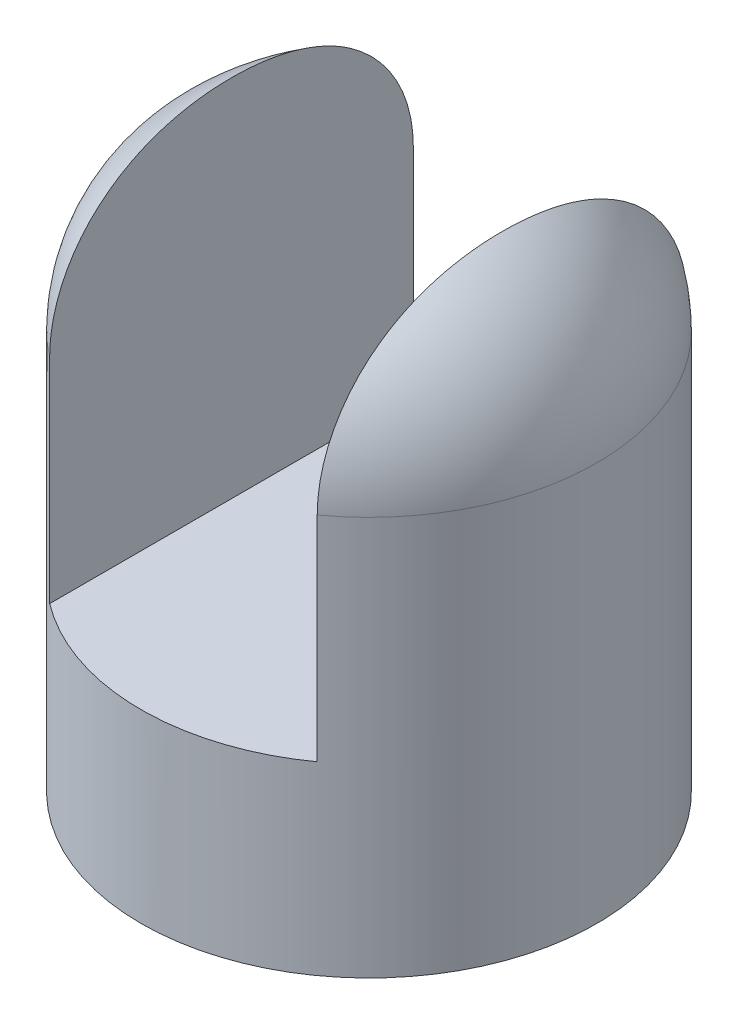
ISO-10303-21;
HEADER;
FILE_DESCRIPTION(('STEP AP214'),'2;1');
FILE_NAME('part.step','',(''),(''),'','','');
FILE_SCHEMA(('AUTOMOTIVE_DESIGN { 1 0 10303 214 1 1 1 1 }'));
ENDSEC;
DATA;
#1=APPLICATION_CONTEXT('core data for automotive mechanical design processes');
#2=APPLICATION_PROTOCOL_DEFINITION('international standard','automotive_design',2000,#1);
#3=PRODUCT_CONTEXT('',#1,'mechanical');
#4=PRODUCT('Part','Part','',(#3));
#5=PRODUCT_RELATED_PRODUCT_CATEGORY('part','',(#4));
#6=PRODUCT_DEFINITION_FORMATION('','',#4);
#7=PRODUCT_DEFINITION_CONTEXT('part definition',#1,'design');
#8=PRODUCT_DEFINITION('design','',#6,#7);
#9=PRODUCT_DEFINITION_SHAPE('','',#8);
#10=(LENGTH_UNIT() NAMED_UNIT(*) SI_UNIT(.MILLI.,.METRE.));
#11=(NAMED_UNIT(*) PLANE_ANGLE_UNIT() SI_UNIT($,.RADIAN.));
#12=(NAMED_UNIT(*) SI_UNIT($,.STERADIAN.) SOLID_ANGLE_UNIT());
#13=UNCERTAINTY_MEASURE_WITH_UNIT(LENGTH_MEASURE(1.E-05),#10,'distance_accuracy_value','');
#14=(GEOMETRIC_REPRESENTATION_CONTEXT(3) GLOBAL_UNCERTAINTY_ASSIGNED_CONTEXT((#13)) GLOBAL_UNIT_ASSIGNED_CONTEXT((#10,
#11,#12)) REPRESENTATION_CONTEXT('',''));
#15=CARTESIAN_POINT('',(0.,0.,0.));
#16=DIRECTION('',(0.,0.,1.));
#17=DIRECTION('',(1.,0.,0.));
#18=AXIS2_PLACEMENT_3D('',#15,#16,#17);
#19=CARTESIAN_POINT('',(0.,140.,0.));
#20=DIRECTION('',(0.,1.,0.));
#21=DIRECTION('',(0.,0.,1.));
#22=AXIS2_PLACEMENT_3D('',#19,#20,#21);
#23=DEGENERATE_TOROIDAL_SURFACE('',#22,20.,60.,.T.);
#24=CARTESIAN_POINT('',(46.75,193.70695951178,0.));
#25=CARTESIAN_POINT('',(46.75,193.706959355465,-1.04296900027614));
#26=CARTESIAN_POINT('',(46.75,193.689592250468,-2.0859364663582));
#27=CARTESIAN_POINT('',(46.75,193.619924922244,-4.1707079732286));
#28=CARTESIAN_POINT('',(46.75,193.567624743968,-5.21251201551227));
#29=CARTESIAN_POINT('',(46.75,193.42750611643,-7.29379594061906));
#30=CARTESIAN_POINT('',(46.75,193.339685760588,-8.33327569567168));
#31=CARTESIAN_POINT('',(46.75,193.127608802382,-10.4085165200169));
#32=CARTESIAN_POINT('',(46.75,193.003352322436,-11.4442776017916));
#33=CARTESIAN_POINT('',(46.75,192.717489338953,-13.5085659530315));
#34=CARTESIAN_POINT('',(46.75,192.555957886585,-14.5371035351462));
#35=CARTESIAN_POINT('',(46.75,192.194048713823,-16.5873376307818));
#36=CARTESIAN_POINT('',(46.75,191.993668130483,-17.6090336343752));
#37=CARTESIAN_POINT('',(46.75,191.332109944078,-20.6605865099879));
#38=CARTESIAN_POINT('',(46.75,190.810391226477,-22.6778307828778));
#39=CARTESIAN_POINT('',(46.75,189.702716323285,-26.3039893667464));
#40=CARTESIAN_POINT('',(46.75,189.144870256703,-27.921490982772));
#41=CARTESIAN_POINT('',(46.75,188.216822968061,-30.3121250565437));
#42=CARTESIAN_POINT('',(46.75,187.892231571076,-31.1031278129538));
#43=CARTESIAN_POINT('',(46.75,187.212126523189,-32.671697589858));
#44=CARTESIAN_POINT('',(46.75,186.856615431585,-33.4492657159952));
#45=CARTESIAN_POINT('',(46.75,186.114288613802,-34.9893362948177));
#46=CARTESIAN_POINT('',(46.75,185.727472312559,-35.7518384704277));
#47=CARTESIAN_POINT('',(46.75,184.922362979877,-37.2599550036553));
#48=CARTESIAN_POINT('',(46.75,184.504073247336,-38.0055711205623));
#49=CARTESIAN_POINT('',(46.75,183.635859430898,-39.4783077937409));
#50=CARTESIAN_POINT('',(46.75,183.185930920142,-40.2054257423118));
#51=CARTESIAN_POINT('',(46.75,182.254643781824,-41.6391491043174));
#52=CARTESIAN_POINT('',(46.75,181.77328858633,-42.345756745522));
#53=CARTESIAN_POINT('',(46.75,180.775417611267,-43.7422226436057));
#54=CARTESIAN_POINT('',(46.75,180.258652569201,-44.4319029220102));
#55=CARTESIAN_POINT('',(46.75,179.193931737608,-45.7866336319624));
#56=CARTESIAN_POINT('',(46.75,178.645979661751,-46.4516869805171));
#57=CARTESIAN_POINT('',(46.75,177.519356154677,-47.7554611258036));
#58=CARTESIAN_POINT('',(46.75,176.940679398783,-48.3941773239298));
#59=CARTESIAN_POINT('',(46.75,175.753569969113,-49.64319125844));
#60=CARTESIAN_POINT('',(46.75,175.145141082172,-50.2534925922481));
#61=CARTESIAN_POINT('',(46.75,173.899472000412,-51.4438750298461));
#62=CARTESIAN_POINT('',(46.75,173.262233804862,-52.0239582246785));
#63=CARTESIAN_POINT('',(46.75,171.960132152541,-53.1520772032915));
#64=CARTESIAN_POINT('',(46.75,171.295272233073,-53.7001170691092));
#65=CARTESIAN_POINT('',(46.75,169.939158106685,-54.7624804514655));
#66=CARTESIAN_POINT('',(46.75,169.247905140668,-55.2768055500647));
#67=CARTESIAN_POINT('',(46.75,167.84052464221,-56.2700562293278));
#68=CARTESIAN_POINT('',(46.75,167.124397965263,-56.7489830256926));
#69=CARTESIAN_POINT('',(46.75,165.11995612022,-58.0170944617484));
#70=CARTESIAN_POINT('',(46.75,163.807160806099,-58.7680816227451));
#71=CARTESIAN_POINT('',(46.75,161.119452158116,-60.1485290778007));
#72=CARTESIAN_POINT('',(46.75,159.744544141508,-60.7779997502303));
#73=CARTESIAN_POINT('',(46.75,156.943628601205,-61.9087904702172));
#74=CARTESIAN_POINT('',(46.75,155.51764412838,-62.4101675160393));
#75=CARTESIAN_POINT('',(46.75,152.625642641165,-63.2797554126105));
#76=CARTESIAN_POINT('',(46.75,151.159627289038,-63.647971783776));
#77=CARTESIAN_POINT('',(46.75,148.307315766803,-64.2255642639269));
#78=CARTESIAN_POINT('',(46.75,146.922952754579,-64.4445264503466));
#79=CARTESIAN_POINT('',(46.75,144.140563727809,-64.7625208226389));
#80=CARTESIAN_POINT('',(46.75,142.742538521351,-64.8615600589238));
#81=CARTESIAN_POINT('',(46.75,139.943382380733,-64.9387897248246));
#82=CARTESIAN_POINT('',(46.75,138.542251969958,-64.9169991704336));
#83=CARTESIAN_POINT('',(46.75,135.747068985271,-64.7528175365386));
#84=CARTESIAN_POINT('',(46.75,134.35301641142,-64.6104264559966));
#85=CARTESIAN_POINT('',(46.75,131.611697684981,-64.2106615651844));
#86=CARTESIAN_POINT('',(46.75,130.264066040833,-63.9557877873997));
#87=CARTESIAN_POINT('',(46.75,127.594928265786,-63.3340503569763));
#88=CARTESIAN_POINT('',(46.75,126.273421569365,-62.9671891313379));
#89=CARTESIAN_POINT('',(46.75,123.66565455782,-62.1247414058643));
#90=CARTESIAN_POINT('',(46.75,122.379391871626,-61.6491622403308));
#91=CARTESIAN_POINT('',(46.75,119.850545252717,-60.5934118670751));
#92=CARTESIAN_POINT('',(46.75,118.607961938597,-60.0132391787917));
#93=CARTESIAN_POINT('',(46.75,116.160215530037,-58.7459545804263));
#94=CARTESIAN_POINT('',(46.75,114.955656901199,-58.0576757489175));
#95=CARTESIAN_POINT('',(46.75,112.60675832066,-56.5851348742164));
#96=CARTESIAN_POINT('',(46.75,111.462418357641,-55.8008728490632));
#97=CARTESIAN_POINT('',(46.75,109.240313733237,-54.142900266252));
#98=CARTESIAN_POINT('',(46.75,108.162559735756,-53.2691754401431));
#99=CARTESIAN_POINT('',(46.75,106.079186159357,-51.4393987348995));
#100=CARTESIAN_POINT('',(46.75,105.073568833472,-50.4833442864281));
#101=CARTESIAN_POINT('',(46.75,103.59982519235,-48.9698926162134));
#102=CARTESIAN_POINT('',(46.75,103.103744353783,-48.4394052566122));
#103=CARTESIAN_POINT('',(46.75,102.133101510036,-47.3590781820884));
#104=CARTESIAN_POINT('',(46.75,101.658538843693,-46.8092390626869));
#105=CARTESIAN_POINT('',(46.75,100.731410342164,-45.6913899844499));
#106=CARTESIAN_POINT('',(46.75,100.278843048312,-45.1233812347214));
#107=CARTESIAN_POINT('',(46.75,99.3959533090566,-43.9702442278246));
#108=CARTESIAN_POINT('',(46.75,98.9656341766164,-43.3851134412202));
#109=CARTESIAN_POINT('',(46.75,97.7089142781767,-41.6063711027726));
#110=CARTESIAN_POINT('',(46.75,96.916193180499,-40.3887350904115));
#111=CARTESIAN_POINT('',(46.75,95.4218425355682,-37.8987083505486));
#112=CARTESIAN_POINT('',(46.75,94.7202298586646,-36.6263075402788));
#113=CARTESIAN_POINT('',(46.75,93.6191412541539,-34.4529673178528));
#114=CARTESIAN_POINT('',(46.75,93.195125212839,-33.564350658742));
#115=CARTESIAN_POINT('',(46.75,92.3883676104953,-31.7687848654886));
#116=CARTESIAN_POINT('',(46.75,92.0056175514726,-30.8618395516621));
#117=CARTESIAN_POINT('',(46.75,91.2804884095964,-29.0316235417884));
#118=CARTESIAN_POINT('',(46.75,90.9381226017503,-28.1083475916287));
#119=CARTESIAN_POINT('',(46.75,90.2929890708497,-26.2481010022608));
#120=CARTESIAN_POINT('',(46.75,89.9902236156741,-25.311129582138));
#121=CARTESIAN_POINT('',(46.75,89.1379675597991,-22.4769512974009));
#122=CARTESIAN_POINT('',(46.75,88.6466329909228,-20.5618738591813));
#123=CARTESIAN_POINT('',(46.75,88.0187115735033,-17.6664664762047));
#124=CARTESIAN_POINT('',(46.75,87.8275678903318,-16.6974128568714));
#125=CARTESIAN_POINT('',(46.75,87.4803139626789,-14.7530503796455));
#126=CARTESIAN_POINT('',(46.75,87.3242014838578,-13.7777419247788));
#127=CARTESIAN_POINT('',(46.75,87.0044325794007,-11.5315067771186));
#128=CARTESIAN_POINT('',(46.75,86.8523415591451,-10.2589305359459));
#129=CARTESIAN_POINT('',(46.75,86.6029249537858,-7.70838942249325));
#130=CARTESIAN_POINT('',(46.75,86.5056027666404,-6.4304242208269));
#131=CARTESIAN_POINT('',(46.75,86.3641403009632,-3.87103524887993));
#132=CARTESIAN_POINT('',(46.75,86.3200221207468,-2.58961026289296));
#133=CARTESIAN_POINT('',(46.75,86.2842859947163,-0.0260616712545729));
#134=CARTESIAN_POINT('',(46.75,86.2926669325234,1.25606191896151));
#135=CARTESIAN_POINT('',(46.75,86.3620414585753,3.81774962660607));
#136=CARTESIAN_POINT('',(46.75,86.42298808042,5.09731500709556));
#137=CARTESIAN_POINT('',(46.75,86.5984594916663,7.65281747074327));
#138=CARTESIAN_POINT('',(46.75,86.7129856077716,8.92875446327039));
#139=CARTESIAN_POINT('',(46.75,86.9973418591094,11.4738594311755));
#140=CARTESIAN_POINT('',(46.75,87.1671445863849,12.7430304450184));
#141=CARTESIAN_POINT('',(46.75,87.5644018427874,15.2721997726354));
#142=CARTESIAN_POINT('',(46.75,87.7918512986225,16.5321988835644));
#143=CARTESIAN_POINT('',(46.75,88.4179029806281,19.5790886990057));
#144=CARTESIAN_POINT('',(46.75,88.8480479592862,21.3596251248479));
#145=CARTESIAN_POINT('',(46.75,89.8398841261424,24.8839703714337));
#146=CARTESIAN_POINT('',(46.75,90.4015647288397,26.6277821353404));
#147=CARTESIAN_POINT('',(46.75,91.3470732963276,29.2033792222277));
#148=CARTESIAN_POINT('',(46.75,91.6790470507545,30.0544433929371));
#149=CARTESIAN_POINT('',(46.75,92.3780726532325,31.742008441715));
#150=CARTESIAN_POINT('',(46.75,92.7451210425534,32.5785107461404));
#151=CARTESIAN_POINT('',(46.75,93.5148116166365,34.234956881433));
#152=CARTESIAN_POINT('',(46.75,93.9174523108858,35.0549014039321));
#153=CARTESIAN_POINT('',(46.75,94.758608744591,36.6760999411685));
#154=CARTESIAN_POINT('',(46.75,95.1971232044855,37.4773546212345));
#155=CARTESIAN_POINT('',(46.75,96.4291586903317,39.6115489365045));
#156=CARTESIAN_POINT('',(46.75,97.2567556345636,40.9250643695513));
#157=CARTESIAN_POINT('',(46.75,99.0151200746949,43.4809447405424));
#158=CARTESIAN_POINT('',(46.75,99.9458784965012,44.7233159217851));
#159=CARTESIAN_POINT('',(46.75,101.908564120026,47.1266382928908));
#160=CARTESIAN_POINT('',(46.75,102.940541478069,48.287548623277));
#161=CARTESIAN_POINT('',(46.75,105.100797232742,50.5161976417054));
#162=CARTESIAN_POINT('',(46.75,106.229077487043,51.5839345316398));
#163=CARTESIAN_POINT('',(46.75,108.580591612138,53.61984454103));
#164=CARTESIAN_POINT('',(46.75,109.804204195847,54.5875808982611));
#165=CARTESIAN_POINT('',(46.75,112.334176687673,56.408252476526));
#166=CARTESIAN_POINT('',(46.75,113.640537944739,57.2611858253587));
#167=CARTESIAN_POINT('',(46.75,116.325962574945,58.8428182690556));
#168=CARTESIAN_POINT('',(46.75,117.705004414626,59.5715538927372));
#169=CARTESIAN_POINT('',(46.75,120.525101007595,60.897029382309));
#170=CARTESIAN_POINT('',(46.75,121.966150874337,61.4937796266378));
#171=CARTESIAN_POINT('',(46.75,124.778109502474,62.5054761452741));
#172=CARTESIAN_POINT('',(46.75,126.145115110782,62.9313001134091));
#173=CARTESIAN_POINT('',(46.75,128.911051086245,63.6620125499558));
#174=CARTESIAN_POINT('',(46.75,130.309979609313,63.9669079854211));
#175=CARTESIAN_POINT('',(46.75,133.128874370563,64.4527753386829));
#176=CARTESIAN_POINT('',(46.75,134.548835867649,64.6337747626386));
#177=CARTESIAN_POINT('',(46.75,137.399180130897,64.8702008165685));
#178=CARTESIAN_POINT('',(46.75,138.829562751189,64.9256292008501));
#179=CARTESIAN_POINT('',(46.75,141.635803520639,64.9106719005193));
#180=CARTESIAN_POINT('',(46.75,143.011688740877,64.8449403682032));
#181=CARTESIAN_POINT('',(46.75,145.75292634814,64.5972904608244));
#182=CARTESIAN_POINT('',(46.75,147.118279074878,64.4153758490884));
#183=CARTESIAN_POINT('',(46.75,149.828618344037,63.9370221632662));
#184=CARTESIAN_POINT('',(46.75,151.173606862302,63.6405942748293));
#185=CARTESIAN_POINT('',(46.75,153.833941588073,62.9358630375574));
#186=CARTESIAN_POINT('',(46.75,155.149287546886,62.5275587504951));
#187=CARTESIAN_POINT('',(46.75,157.739878376959,61.603214489203));
#188=CARTESIAN_POINT('',(46.75,159.015166388027,61.0872953302003));
#189=CARTESIAN_POINT('',(46.75,161.518763101622,59.951962650212));
#190=CARTESIAN_POINT('',(46.75,162.747072159306,59.3325499118212));
#191=CARTESIAN_POINT('',(46.75,165.149063633095,57.9955253562769));
#192=CARTESIAN_POINT('',(46.75,166.322743427309,57.2779088324064));
#193=CARTESIAN_POINT('',(46.75,168.608512677396,55.7505499503786));
#194=CARTESIAN_POINT('',(46.75,169.72060081223,54.9408056173689));
#195=CARTESIAN_POINT('',(46.75,171.91101889656,53.2090887511299));
#196=CARTESIAN_POINT('',(46.75,172.987194320122,52.2843917869976));
#197=CARTESIAN_POINT('',(46.75,175.062116952993,50.351952819365));
#198=CARTESIAN_POINT('',(46.75,176.060863139526,49.3442097192572));
#199=CARTESIAN_POINT('',(46.75,177.976633475867,47.2539390805297));
#200=CARTESIAN_POINT('',(46.75,178.893658563713,46.171412400568));
#201=CARTESIAN_POINT('',(46.75,180.642996624587,43.9400199458809));
#202=CARTESIAN_POINT('',(46.75,181.475306600549,42.7911518263678));
#203=CARTESIAN_POINT('',(46.75,183.1145334946,40.3444145110728));
#204=CARTESIAN_POINT('',(46.75,183.914505718226,39.0418939372309));
#205=CARTESIAN_POINT('',(46.75,185.413558793557,36.3801661219372));
#206=CARTESIAN_POINT('',(46.75,186.112636092806,35.0209568866784));
#207=CARTESIAN_POINT('',(46.75,187.411270205964,32.2552807430195));
#208=CARTESIAN_POINT('',(46.75,188.010789241212,30.8487961376899));
#209=CARTESIAN_POINT('',(46.75,189.112569327126,27.9983716210833));
#210=CARTESIAN_POINT('',(46.75,189.614822088047,26.5544285292014));
#211=CARTESIAN_POINT('',(46.75,190.701783290348,23.0737321640487));
#212=CARTESIAN_POINT('',(46.75,191.243432882121,21.0233866860826));
#213=CARTESIAN_POINT('',(46.75,191.930019166044,17.9206676525278));
#214=CARTESIAN_POINT('',(46.75,192.137939607997,16.8816061202439));
#215=CARTESIAN_POINT('',(46.75,192.51341875749,14.7961544785234));
#216=CARTESIAN_POINT('',(46.75,192.680978125457,13.7497644892905));
#217=CARTESIAN_POINT('',(46.75,192.97748887142,11.6492347367863));
#218=CARTESIAN_POINT('',(46.75,193.106354768251,10.5950830099672));
#219=CARTESIAN_POINT('',(46.75,193.326266552774,8.48284337026949));
#220=CARTESIAN_POINT('',(46.75,193.417312196765,7.42475543207131));
#221=CARTESIAN_POINT('',(46.75,193.562558195086,5.30616779914778));
#222=CARTESIAN_POINT('',(46.75,193.616762067512,4.24566834440959));
#223=CARTESIAN_POINT('',(46.75,193.688962740668,2.12344539356614));
#224=CARTESIAN_POINT('',(46.75,193.706959670906,1.06172190185276));
#225=CARTESIAN_POINT('',(46.75,193.70695951178,0.));
#226=B_SPLINE_CURVE_WITH_KNOTS('',3,(#24,#25,#26,#27,#28,#29,#30,#31,#32,#33,#34,#35,#36,#37,
#38,#39,#40,#41,#42,#43,#44,#45,#46,#47,#48,#49,#50,#51,#52,#53,#54,#55,#56,#57,#58,#59,#60,#61,
#62,#63,#64,#65,#66,#67,#68,#69,#70,#71,#72,#73,#74,#75,#76,#77,#78,#79,#80,#81,#82,#83,#84,#85,
#86,#87,#88,#89,#90,#91,#92,#93,#94,#95,#96,#97,#98,#99,#100,#101,#102,#103,#104,#105,#106,#107,
#108,#109,#110,#111,#112,#113,#114,#115,#116,#117,#118,#119,#120,#121,#122,#123,#124,#125,#126,
#127,#128,#129,#130,#131,#132,#133,#134,#135,#136,#137,#138,#139,#140,#141,#142,#143,#144,#145,
#146,#147,#148,#149,#150,#151,#152,#153,#154,#155,#156,#157,#158,#159,#160,#161,#162,#163,#164,
#165,#166,#167,#168,#169,#170,#171,#172,#173,#174,#175,#176,#177,#178,#179,#180,#181,#182,#183,
#184,#185,#186,#187,#188,#189,#190,#191,#192,#193,#194,#195,#196,#197,#198,#199,#200,#201,#202,
#203,#204,#205,#206,#207,#208,#209,#210,#211,#212,#213,#214,#215,#216,#217,#218,#219,#220,#221,
#222,#223,#224,#225),.UNSPECIFIED.,.T.,.F.,(4,2,2,2,2,2,2,2,2,2,2,2,2,2,2,2,2,2,2,2,2,2,2,2,2,2,
2,2,2,2,2,2,2,2,2,2,2,2,2,2,2,2,2,2,2,2,2,2,2,2,2,2,2,2,2,2,2,2,2,2,2,2,2,2,2,2,2,2,2,2,2,2,2,2,
2,2,2,2,2,2,2,2,2,2,2,2,2,2,2,2,2,2,2,2,2,2,2,2,2,2,4),(0.,3.12875838725811,6.25751274854812,
9.38643507117931,12.515346881514,15.6380129307092,18.7609091891814,25.0039163159907,
30.1320333740228,32.6964973969225,35.2607493545228,37.825048427029,40.3890790950564,
42.9534692357021,45.5175797895031,48.1020898176859,50.6862927305482,53.2709449645918,
55.8552690775879,58.4394141216753,61.0232292480375,63.6069230423372,66.1905280623356,
70.7212574316843,75.2515996732195,79.7799225077717,84.3080575909859,88.5076625471185,
92.707020591509,96.9057177666205,101.104414977875,105.214155237691,109.323806437235,
113.433180474324,117.54261268574,121.699911951743,125.857210436421,130.015173005828,
134.173265383687,136.351685518215,138.530038673677,140.708247169914,142.886779093534,
147.241224085892,151.596474235154,154.549278249861,157.50147302102,160.454635541527,
163.407967113171,169.331958977305,172.29467591728,175.257203837242,179.100833821682,
182.944702245662,186.790166673359,190.635549328635,194.477499765536,198.319545339564,
202.159688795579,205.999494410941,211.490028916702,216.980121716292,219.720020494201,
222.45964936736,225.199163566306,227.938580093602,232.590883064613,237.242777142893,
241.896988101254,246.551288859059,251.225127366692,255.899042085786,260.571579739972,
265.243749846634,269.533784825143,273.823572606018,278.112407701748,282.401182879355,
286.528632920639,290.655949275024,294.782862575315,298.909810486133,303.032149924543,
307.154458192174,311.276964103282,315.399558401113,319.651524326066,323.903546406379,
328.155519673493,332.407643315459,336.988691122153,341.569900185777,346.152843695218,
350.736177624961,357.08947528202,360.267866053776,363.446204814105,366.631514318336,
369.816844347419,373.001870159939,376.186884579809),.UNSPECIFIED.);
#227=CARTESIAN_POINT('',(46.75,140.,64.9186991551741));
#228=VERTEX_POINT('',#227);
#229=CARTESIAN_POINT('',(46.75,140.,-64.9186991551741));
#230=VERTEX_POINT('',#229);
#231=EDGE_CURVE('E104',#228,#230,#226,.T.);
#232=ORIENTED_EDGE('',*,*,#231,.F.);
#233=CARTESIAN_POINT('',(0.,140.,0.));
#234=DIRECTION('',(0.,1.,0.));
#235=DIRECTION('',(0.,0.,1.));
#236=AXIS2_PLACEMENT_3D('',#233,#234,#235);
#237=CIRCLE('',#236,80.);
#238=EDGE_CURVE('E100',#230,#228,#237,.F.);
#239=ORIENTED_EDGE('',*,*,#238,.F.);
#240=EDGE_LOOP('',(#232,#239));
#241=FACE_BOUND('',#240,.T.);
#242=ADVANCED_FACE('F35',(#241),#23,.T.);
#243=CARTESIAN_POINT('',(-48.25,192.933330709488,0.));
#244=CARTESIAN_POINT('',(-48.25,192.9333319632,1.08571551419539));
#245=CARTESIAN_POINT('',(-48.25,192.913791301091,2.17144919568749));
#246=CARTESIAN_POINT('',(-48.25,192.835412403958,4.34153036277203));
#247=CARTESIAN_POINT('',(-48.25,192.776572826786,5.42587779975379));
#248=CARTESIAN_POINT('',(-48.25,192.618940273872,7.59190810296991));
#249=CARTESIAN_POINT('',(-48.25,192.520138907772,8.67359036161056));
#250=CARTESIAN_POINT('',(-48.25,192.281579615297,10.8324294877795));
#251=CARTESIAN_POINT('',(-48.25,192.141822272431,11.9095864195596));
#252=CARTESIAN_POINT('',(-48.25,191.820237211103,14.0563643656184));
#253=CARTESIAN_POINT('',(-48.25,191.638457855564,15.1259925974335));
#254=CARTESIAN_POINT('',(-48.25,191.231253650869,17.2569483485123));
#255=CARTESIAN_POINT('',(-48.25,191.005828052947,18.318275725047));
#256=CARTESIAN_POINT('',(-48.25,190.509827939357,20.4299984796212));
#257=CARTESIAN_POINT('',(-48.25,190.23926891627,21.4803974779625));
#258=CARTESIAN_POINT('',(-48.25,189.651423893524,23.5680051159597));
#259=CARTESIAN_POINT('',(-48.25,189.334136930038,24.6052134830613));
#260=CARTESIAN_POINT('',(-48.25,188.466689678508,27.2202731813144));
#261=CARTESIAN_POINT('',(-48.25,187.883345131447,28.7873766482879));
#262=CARTESIAN_POINT('',(-48.25,186.919443970762,31.1005394939594));
#263=CARTESIAN_POINT('',(-48.25,186.583302334835,31.865398356929));
#264=CARTESIAN_POINT('',(-48.25,185.880975499115,33.3811924391584));
#265=CARTESIAN_POINT('',(-48.25,185.514792710376,34.1321287698989));
#266=CARTESIAN_POINT('',(-48.25,184.752237291864,35.6182210890311));
#267=CARTESIAN_POINT('',(-48.25,184.355873953615,36.3533818455361));
#268=CARTESIAN_POINT('',(-48.25,183.532775767678,37.8064161118794));
#269=CARTESIAN_POINT('',(-48.25,183.106044122131,38.5242914337028));
#270=CARTESIAN_POINT('',(-48.25,182.222133884082,39.9412025442823));
#271=CARTESIAN_POINT('',(-48.25,181.764950940685,40.6402356207214));
#272=CARTESIAN_POINT('',(-48.25,180.820419881309,42.0175187351303));
#273=CARTESIAN_POINT('',(-48.25,180.333075037953,42.6957710159583));
#274=CARTESIAN_POINT('',(-48.25,179.324618396222,44.03495549128));
#275=CARTESIAN_POINT('',(-48.25,178.80327440804,44.6957129648214));
#276=CARTESIAN_POINT('',(-48.25,177.730811935111,45.9924882761472));
#277=CARTESIAN_POINT('',(-48.25,177.179696972795,46.6285090254728));
#278=CARTESIAN_POINT('',(-48.25,176.048208134746,47.8741810216676));
#279=CARTESIAN_POINT('',(-48.25,175.467829303301,48.4838277695133));
#280=CARTESIAN_POINT('',(-48.25,174.278806643844,49.6747651785772));
#281=CARTESIAN_POINT('',(-48.25,173.670166382315,50.2560593988937));
#282=CARTESIAN_POINT('',(-48.25,172.425547026146,51.388613455201));
#283=CARTESIAN_POINT('',(-48.25,171.789568055252,51.939873427114));
#284=CARTESIAN_POINT('',(-48.25,170.49150506143,53.0105839388733));
#285=CARTESIAN_POINT('',(-48.25,169.829424350336,53.5300384930288));
#286=CARTESIAN_POINT('',(-48.25,168.480390302052,54.5355580159965));
#287=CARTESIAN_POINT('',(-48.25,167.793438051857,55.0216244413339));
#288=CARTESIAN_POINT('',(-48.25,166.39617487224,55.9587765794219));
#289=CARTESIAN_POINT('',(-48.25,165.685864717867,56.4098634511816));
#290=CARTESIAN_POINT('',(-48.25,163.694847930992,57.6047995922285));
#291=CARTESIAN_POINT('',(-48.25,162.390973512894,58.310555459712));
#292=CARTESIAN_POINT('',(-48.25,159.725206844957,59.601684340048));
#293=CARTESIAN_POINT('',(-48.25,158.363319416346,60.187067333135));
#294=CARTESIAN_POINT('',(-48.25,155.59246302188,61.2312406598026));
#295=CARTESIAN_POINT('',(-48.25,154.183515431405,61.6900876142381));
#296=CARTESIAN_POINT('',(-48.25,151.329471000883,62.4765656096238));
#297=CARTESIAN_POINT('',(-48.25,149.884375635811,62.8042019952438));
#298=CARTESIAN_POINT('',(-48.25,147.074145296241,63.3061705448695));
#299=CARTESIAN_POINT('',(-48.25,145.710658024489,63.489769778031));
#300=CARTESIAN_POINT('',(-48.25,142.972990387269,63.7390634662744));
#301=CARTESIAN_POINT('',(-48.25,141.598810645493,63.8047647473386));
#302=CARTESIAN_POINT('',(-48.25,138.850120477013,63.817652095959));
#303=CARTESIAN_POINT('',(-48.25,137.475610136003,63.7648567537855));
#304=CARTESIAN_POINT('',(-48.25,134.736213602475,63.5412876826879));
#305=CARTESIAN_POINT('',(-48.25,133.37132741851,63.3705138489474));
#306=CARTESIAN_POINT('',(-48.25,130.688336315201,62.9171799515503));
#307=CARTESIAN_POINT('',(-48.25,129.36984158746,62.6369218272273));
#308=CARTESIAN_POINT('',(-48.25,126.760935232161,61.9671724639419));
#309=CARTESIAN_POINT('',(-48.25,125.470523013014,61.5776835284507));
#310=CARTESIAN_POINT('',(-48.25,122.926572686312,60.6929593555894));
#311=CARTESIAN_POINT('',(-48.25,121.673032762485,60.1977293368161));
#312=CARTESIAN_POINT('',(-48.25,119.210941494718,59.1058579678533));
#313=CARTESIAN_POINT('',(-48.25,118.002390867303,58.5092150033456));
#314=CARTESIAN_POINT('',(-48.25,115.620518480437,57.2102380557373));
#315=CARTESIAN_POINT('',(-48.25,114.44797059388,56.5064857664885));
#316=CARTESIAN_POINT('',(-48.25,112.164000154855,55.0060139872962));
#317=CARTESIAN_POINT('',(-48.25,111.052577701728,54.20929434627));
#318=CARTESIAN_POINT('',(-48.25,108.896849202918,52.5295709429017));
#319=CARTESIAN_POINT('',(-48.25,107.852552130598,51.6465556841089));
#320=CARTESIAN_POINT('',(-48.25,105.836179801016,49.8014208295923));
#321=CARTESIAN_POINT('',(-48.25,104.864106933354,48.8392986187653));
#322=CARTESIAN_POINT('',(-48.25,103.438630655884,47.3163124149775));
#323=CARTESIAN_POINT('',(-48.25,102.957519155599,46.7810877275352));
#324=CARTESIAN_POINT('',(-48.25,102.016883417651,45.6919749563471));
#325=CARTESIAN_POINT('',(-48.25,101.557358573409,45.1380873977747));
#326=CARTESIAN_POINT('',(-48.25,100.660315434848,44.0128352896277));
#327=CARTESIAN_POINT('',(-48.25,100.222795804922,43.4414718041481));
#328=CARTESIAN_POINT('',(-48.25,99.3699640452712,42.2823258080927));
#329=CARTESIAN_POINT('',(-48.25,98.9546550665437,41.6945409857557));
#330=CARTESIAN_POINT('',(-48.25,97.7427074251844,39.9087339420815));
#331=CARTESIAN_POINT('',(-48.25,96.9796212235334,38.6877221248435));
#332=CARTESIAN_POINT('',(-48.25,95.543764811277,36.1935970852425));
#333=CARTESIAN_POINT('',(-48.25,94.8710127601764,34.9204734539733));
#334=CARTESIAN_POINT('',(-48.25,93.8122947009174,32.7374247946349));
#335=CARTESIAN_POINT('',(-48.25,93.4025872437283,31.8389118181592));
#336=CARTESIAN_POINT('',(-48.25,92.6248609234893,30.0242728891725));
#337=CARTESIAN_POINT('',(-48.25,92.2568319164907,29.1081512861221));
#338=CARTESIAN_POINT('',(-48.25,91.5614821099046,27.2603002920085));
#339=CARTESIAN_POINT('',(-48.25,91.2341731297807,26.3285664579472));
#340=CARTESIAN_POINT('',(-48.25,90.6193737860952,24.4519367358842));
#341=CARTESIAN_POINT('',(-48.25,90.3318916770369,23.5070381638927));
#342=CARTESIAN_POINT('',(-48.25,89.5260856946651,20.6504571836437));
#343=CARTESIAN_POINT('',(-48.25,89.0662632544099,18.7218864038609));
#344=CARTESIAN_POINT('',(-48.25,88.4864942546608,15.8078054022948));
#345=CARTESIAN_POINT('',(-48.25,88.3115387550899,14.8326888729938));
#346=CARTESIAN_POINT('',(-48.25,87.9971012366152,12.8767563753989));
#347=CARTESIAN_POINT('',(-48.25,87.8576167870326,11.8959408023497));
#348=CARTESIAN_POINT('',(-48.25,87.5826626422606,9.68546820137213));
#349=CARTESIAN_POINT('',(-48.25,87.4568255682353,8.45461156296912));
#350=CARTESIAN_POINT('',(-48.25,87.2572475390951,5.98902775374241));
#351=CARTESIAN_POINT('',(-48.25,87.1834934128807,4.7543016408488));
#352=CARTESIAN_POINT('',(-48.25,87.0869797711344,2.28230326728247));
#353=CARTESIAN_POINT('',(-48.25,87.0642434579207,1.04503010416359));
#354=CARTESIAN_POINT('',(-48.25,87.0695038417232,-1.4294848655782));
#355=CARTESIAN_POINT('',(-48.25,87.0975036897625,-2.66672666548091));
#356=CARTESIAN_POINT('',(-48.25,87.2045762335814,-5.13734554639688));
#357=CARTESIAN_POINT('',(-48.25,87.2835802645973,-6.37072558642542));
#358=CARTESIAN_POINT('',(-48.25,87.4936886873024,-8.83306142791268));
#359=CARTESIAN_POINT('',(-48.25,87.6247931736754,-10.062017221327));
#360=CARTESIAN_POINT('',(-48.25,87.9407024819119,-12.5124556117583));
#361=CARTESIAN_POINT('',(-48.25,88.1254815807552,-13.7339415030102));
#362=CARTESIAN_POINT('',(-48.25,88.5508390951906,-16.1671710864343));
#363=CARTESIAN_POINT('',(-48.25,88.7914184003145,-17.3789146229813));
#364=CARTESIAN_POINT('',(-48.25,89.4515416266604,-20.3296581879015));
#365=CARTESIAN_POINT('',(-48.25,89.9029756304593,-22.0616545841444));
#366=CARTESIAN_POINT('',(-48.25,90.9347738123433,-25.4870020926574));
#367=CARTESIAN_POINT('',(-48.25,91.5151223716911,-27.1803578590781));
#368=CARTESIAN_POINT('',(-48.25,92.4861933640443,-29.6800167363912));
#369=CARTESIAN_POINT('',(-48.25,92.8264741999896,-30.5061614437876));
#370=CARTESIAN_POINT('',(-48.25,93.5411555929906,-32.1435260340989));
#371=CARTESIAN_POINT('',(-48.25,93.9155526666965,-32.9547474305771));
#372=CARTESIAN_POINT('',(-48.25,94.6989389542402,-34.5604673680018));
#373=CARTESIAN_POINT('',(-48.25,95.1079333208298,-35.3549633958701));
#374=CARTESIAN_POINT('',(-48.25,95.9606524783998,-36.9250064233716));
#375=CARTESIAN_POINT('',(-48.25,96.4043735892236,-37.7005554195118));
#376=CARTESIAN_POINT('',(-48.25,97.3313446282409,-39.2385185292259));
#377=CARTESIAN_POINT('',(-48.25,97.8149524781775,-40.0007171298412));
#378=CARTESIAN_POINT('',(-48.25,98.8175305936451,-41.5015006780641));
#379=CARTESIAN_POINT('',(-48.25,99.3365005691584,-42.2400858192612));
#380=CARTESIAN_POINT('',(-48.25,100.409477331561,-43.6914627953378));
#381=CARTESIAN_POINT('',(-48.25,100.963486907259,-44.4042525700426));
#382=CARTESIAN_POINT('',(-48.25,102.105902116073,-45.8017035345138));
#383=CARTESIAN_POINT('',(-48.25,102.69430692014,-46.4863654015863));
#384=CARTESIAN_POINT('',(-48.25,103.904712496521,-47.8253259938687));
#385=CARTESIAN_POINT('',(-48.25,104.526712909276,-48.4796250438983));
#386=CARTESIAN_POINT('',(-48.25,105.803196483091,-49.7555584836665));
#387=CARTESIAN_POINT('',(-48.25,106.457675080757,-50.3771974372311));
#388=CARTESIAN_POINT('',(-48.25,107.797926374862,-51.5857055479975));
#389=CARTESIAN_POINT('',(-48.25,108.483696507307,-52.1725775449395));
#390=CARTESIAN_POINT('',(-48.25,109.885026282628,-53.3094390005213));
#391=CARTESIAN_POINT('',(-48.25,110.600584525835,-53.8594301889341));
#392=CARTESIAN_POINT('',(-48.25,112.568785429914,-55.2905283225897));
#393=CARTESIAN_POINT('',(-48.25,113.848192113047,-56.1352708983133));
#394=CARTESIAN_POINT('',(-48.25,116.47894049016,-57.7035352949412));
#395=CARTESIAN_POINT('',(-48.25,117.830274445425,-58.4270701220858));
#396=CARTESIAN_POINT('',(-48.25,120.593711206799,-59.7447646617671));
#397=CARTESIAN_POINT('',(-48.25,122.00577681253,-60.3390022590999));
#398=CARTESIAN_POINT('',(-48.25,124.87957934754,-61.3918758922335));
#399=CARTESIAN_POINT('',(-48.25,126.341313386577,-61.8505198033118));
#400=CARTESIAN_POINT('',(-48.25,129.165789435727,-62.5913524668787));
#401=CARTESIAN_POINT('',(-48.25,130.525311691158,-62.8858686169161));
#402=CARTESIAN_POINT('',(-48.25,133.264717439883,-63.3559464659621));
#403=CARTESIAN_POINT('',(-48.25,134.644599401123,-63.531517069376));
#404=CARTESIAN_POINT('',(-48.25,137.414107679579,-63.762007600992));
#405=CARTESIAN_POINT('',(-48.25,138.803731909521,-63.8169526257039));
#406=CARTESIAN_POINT('',(-48.25,141.582501988342,-63.8057377461845));
#407=CARTESIAN_POINT('',(-48.25,142.971647838498,-63.7395781675637));
#408=CARTESIAN_POINT('',(-48.25,145.698179382339,-63.4905213696844));
#409=CARTESIAN_POINT('',(-48.25,147.035885544855,-63.3111156690277));
#410=CARTESIAN_POINT('',(-48.25,149.691435885347,-62.8404655129939));
#411=CARTESIAN_POINT('',(-48.25,151.009280621473,-62.5492242065568));
#412=CARTESIAN_POINT('',(-48.25,153.615902311848,-61.8575405617685));
#413=CARTESIAN_POINT('',(-48.25,154.904680678494,-61.4571035419061));
#414=CARTESIAN_POINT('',(-48.25,157.444521113809,-60.5505881709336));
#415=CARTESIAN_POINT('',(-48.25,158.695582696363,-60.0445084589071));
#416=CARTESIAN_POINT('',(-48.25,161.160595304078,-58.9271758808344));
#417=CARTESIAN_POINT('',(-48.25,162.374216935193,-58.3151967275703));
#418=CARTESIAN_POINT('',(-48.25,164.747249374902,-56.9939685962531));
#419=CARTESIAN_POINT('',(-48.25,165.906660309066,-56.2847198435254));
#420=CARTESIAN_POINT('',(-48.25,168.164492674951,-54.7750110886604));
#421=CARTESIAN_POINT('',(-48.25,169.262912166529,-53.9745481874626));
#422=CARTESIAN_POINT('',(-48.25,171.392833426778,-52.2891112835983));
#423=CARTESIAN_POINT('',(-48.25,172.424333495331,-51.4041351352466));
#424=CARTESIAN_POINT('',(-48.25,174.458451800491,-49.5169765897379));
#425=CARTESIAN_POINT('',(-48.25,175.457907114115,-48.5113858524427));
#426=CARTESIAN_POINT('',(-48.25,177.374319388263,-46.4245363062861));
#427=CARTESIAN_POINT('',(-48.25,178.291274519007,-45.3432758200825));
#428=CARTESIAN_POINT('',(-48.25,180.039793809802,-43.1136324087618));
#429=CARTESIAN_POINT('',(-48.25,180.871345661033,-41.9652398454995));
#430=CARTESIAN_POINT('',(-48.25,182.447229614004,-39.610179214216));
#431=CARTESIAN_POINT('',(-48.25,183.191558668393,-38.4035091121999));
#432=CARTESIAN_POINT('',(-48.25,184.660677526598,-35.82068452749));
#433=CARTESIAN_POINT('',(-48.25,185.376541332192,-34.4394544028247));
#434=CARTESIAN_POINT('',(-48.25,186.703901986385,-31.627818104343));
#435=CARTESIAN_POINT('',(-48.25,187.315391889107,-30.1974086653452));
#436=CARTESIAN_POINT('',(-48.25,188.436725848761,-27.2971852763848));
#437=CARTESIAN_POINT('',(-48.25,188.946554485722,-25.8273653869479));
#438=CARTESIAN_POINT('',(-48.25,189.868283611421,-22.8574715036707));
#439=CARTESIAN_POINT('',(-48.25,190.280182219466,-21.3573969294062));
#440=CARTESIAN_POINT('',(-48.25,191.037061613456,-18.2252161146555));
#441=CARTESIAN_POINT('',(-48.25,191.375028729477,-16.5914203790007));
#442=CARTESIAN_POINT('',(-48.25,191.949261697707,-13.306196204164));
#443=CARTESIAN_POINT('',(-48.25,192.185524762128,-11.6547672829138));
#444=CARTESIAN_POINT('',(-48.25,192.561621442632,-8.33871921763836));
#445=CARTESIAN_POINT('',(-48.25,192.701325684146,-6.6740853879727));
#446=CARTESIAN_POINT('',(-48.25,192.840696256297,-4.17336576238935));
#447=CARTESIAN_POINT('',(-48.25,192.875455445852,-3.33907763402564));
#448=CARTESIAN_POINT('',(-48.25,192.921771851937,-1.66986323888627));
#449=CARTESIAN_POINT('',(-48.25,192.933329745358,-0.834936991438527));
#450=CARTESIAN_POINT('',(-48.25,192.933330709488,0.));
#451=B_SPLINE_CURVE_WITH_KNOTS('',3,(#243,#244,#245,#246,#247,#248,#249,#250,#251,#252,#253,
#254,#255,#256,#257,#258,#259,#260,#261,#262,#263,#264,#265,#266,#267,#268,#269,#270,#271,#272,
#273,#274,#275,#276,#277,#278,#279,#280,#281,#282,#283,#284,#285,#286,#287,#288,#289,#290,#291,
#292,#293,#294,#295,#296,#297,#298,#299,#300,#301,#302,#303,#304,#305,#306,#307,#308,#309,#310,
#311,#312,#313,#314,#315,#316,#317,#318,#319,#320,#321,#322,#323,#324,#325,#326,#327,#328,#329,
#330,#331,#332,#333,#334,#335,#336,#337,#338,#339,#340,#341,#342,#343,#344,#345,#346,#347,#348,
#349,#350,#351,#352,#353,#354,#355,#356,#357,#358,#359,#360,#361,#362,#363,#364,#365,#366,#367,
#368,#369,#370,#371,#372,#373,#374,#375,#376,#377,#378,#379,#380,#381,#382,#383,#384,#385,#386,
#387,#388,#389,#390,#391,#392,#393,#394,#395,#396,#397,#398,#399,#400,#401,#402,#403,#404,#405,
#406,#407,#408,#409,#410,#411,#412,#413,#414,#415,#416,#417,#418,#419,#420,#421,#422,#423,#424,
#425,#426,#427,#428,#429,#430,#431,#432,#433,#434,#435,#436,#437,#438,#439,#440,#441,#442,#443,
#444,#445,#446,#447,#448,#449,#450),.UNSPECIFIED.,.T.,.F.,(4,2,2,2,2,2,2,2,2,2,2,2,2,2,2,2,2,2,
2,2,2,2,2,2,2,2,2,2,2,2,2,2,2,2,2,2,2,2,2,2,2,2,2,2,2,2,2,2,2,2,2,2,2,2,2,2,2,2,2,2,2,2,2,2,2,2,
2,2,2,2,2,2,2,2,2,2,2,2,2,2,2,2,2,2,2,2,2,2,2,2,2,2,2,2,2,2,2,2,2,2,2,2,2,4),(0.,
3.25700076819785,6.51411277607073,9.77190900099871,13.0296588135538,16.2836778017972,
19.5377526187738,22.7907127260876,26.0437399395251,31.0547766066775,33.5606530388535,
36.066328549836,38.5712357469359,41.0758792080657,43.5808813045193,46.0856120783897,
48.6097322610625,51.1335544471803,53.657805476801,56.1817388168592,58.7056607337326,
61.2292634352559,63.7527559770227,66.2761648698857,70.7176538049137,75.1587743430703,
79.5979043844363,84.0368535859661,88.1592190781664,92.281345888507,96.4028260467061,
100.52430986658,104.563436797962,108.602478558196,112.641321027297,116.680227793786,
120.778212329831,124.87620352567,128.974741409096,133.073414835753,135.231968597799,
137.390461668754,139.548823571435,141.70749087026,146.022772881905,150.338921082461,
153.30047651415,156.26130958871,159.223000084407,162.185303503621,168.125859380149,
171.097456334438,174.06884960305,177.779503743127,181.489219170715,185.200621392831,
188.912254123426,192.618900431236,196.325553475292,200.0304330655,203.735371720632,
209.100207578539,214.464393810003,217.144188519022,219.8237099205,222.50363110181,
225.183268662821,227.890317036618,230.597343211591,233.304585111113,236.011761783338,
238.718909487654,241.425677891431,244.132224902605,246.838644883176,251.431199615793,
256.023261226601,260.612549011211,265.201570197726,269.369621782708,273.537361307889,
277.704233640279,281.871094769335,285.915372588691,289.959536542211,294.003503555767,
298.047522667964,302.120463587229,306.193395071667,310.266456042267,314.339620450276,
318.588407084779,322.837287930356,327.08678029266,331.336421077513,335.998984126846,
340.66185733962,345.325437279444,349.98910677349,354.990784980202,359.992600278193,
365.001104346216,367.505876294223,370.010575165112),.UNSPECIFIED.);
#452=CARTESIAN_POINT('',(-48.25,140.,-63.8117348142174));
#453=VERTEX_POINT('',#452);
#454=CARTESIAN_POINT('',(-48.25,140.,63.8117348142174));
#455=VERTEX_POINT('',#454);
#456=EDGE_CURVE('E109',#453,#455,#451,.T.);
#457=ORIENTED_EDGE('',*,*,#456,.F.);
#458=EDGE_CURVE('E95',#455,#453,#237,.F.);
#459=ORIENTED_EDGE('',*,*,#458,.F.);
#460=EDGE_LOOP('',(#457,#459));
#461=FACE_BOUND('',#460,.T.);
#462=ADVANCED_FACE('F37',(#461),#23,.T.);
#463=CARTESIAN_POINT('',(0.,200.,0.));
#464=DIRECTION('',(0.,-1.,0.));
#465=DIRECTION('',(0.,0.,-1.));
#466=AXIS2_PLACEMENT_3D('',#463,#464,#465);
#467=CYLINDRICAL_SURFACE('',#466,80.);
#468=CARTESIAN_POINT('',(0.,65.,0.));
#469=DIRECTION('',(0.,1.,0.));
#470=DIRECTION('',(0.,0.,1.));
#471=AXIS2_PLACEMENT_3D('',#468,#469,#470);
#472=CIRCLE('',#471,80.);
#473=CARTESIAN_POINT('',(46.75,65.,-64.9186991551741));
#474=VERTEX_POINT('',#473);
#475=CARTESIAN_POINT('',(-48.25,65.,-63.8117348142174));
#476=VERTEX_POINT('',#475);
#477=EDGE_CURVE('E77',#474,#476,#472,.T.);
#478=ORIENTED_EDGE('',*,*,#477,.F.);
#479=DIRECTION('',(0.,-1.,0.));
#480=VECTOR('',#479,1.);
#481=CARTESIAN_POINT('',(46.75,200.,-64.9186991551741));
#482=LINE('',#481,#480);
#483=EDGE_CURVE('E11',#474,#230,#482,.F.);
#484=ORIENTED_EDGE('',*,*,#483,.T.);
#485=ORIENTED_EDGE('',*,*,#238,.T.);
#486=DIRECTION('',(0.,-1.,0.));
#487=VECTOR('',#486,1.);
#488=CARTESIAN_POINT('',(46.75,200.,64.9186991551741));
#489=LINE('',#488,#487);
#490=CARTESIAN_POINT('',(46.75,65.,64.9186991551741));
#491=VERTEX_POINT('',#490);
#492=EDGE_CURVE('E59',#228,#491,#489,.T.);
#493=ORIENTED_EDGE('',*,*,#492,.T.);
#494=CARTESIAN_POINT('',(-48.25,65.,63.8117348142174));
#495=VERTEX_POINT('',#494);
#496=EDGE_CURVE('E83',#495,#491,#472,.T.);
#497=ORIENTED_EDGE('',*,*,#496,.F.);
#498=DIRECTION('',(0.,-1.,0.));
#499=VECTOR('',#498,1.);
#500=CARTESIAN_POINT('',(-48.25,200.,63.8117348142174));
#501=LINE('',#500,#499);
#502=EDGE_CURVE('E88',#495,#455,#501,.F.);
#503=ORIENTED_EDGE('',*,*,#502,.T.);
#504=ORIENTED_EDGE('',*,*,#458,.T.);
#505=DIRECTION('',(0.,-1.,0.));
#506=VECTOR('',#505,1.);
#507=CARTESIAN_POINT('',(-48.25,200.,-63.8117348142174));
#508=LINE('',#507,#506);
#509=EDGE_CURVE('E44',#453,#476,#508,.T.);
#510=ORIENTED_EDGE('',*,*,#509,.T.);
#511=EDGE_LOOP('',(#478,#484,#485,#493,#497,#503,#504,#510));
#512=FACE_BOUND('',#511,.T.);
#513=CARTESIAN_POINT('',(0.,0.,0.));
#514=DIRECTION('',(0.,1.,0.));
#515=DIRECTION('',(0.,0.,1.));
#516=AXIS2_PLACEMENT_3D('',#513,#514,#515);
#517=CIRCLE('',#516,80.);
#518=CARTESIAN_POINT('',(0.,0.,80.));
#519=VERTEX_POINT('',#518);
#520=EDGE_CURVE('E101',#519,#519,#517,.T.);
#521=ORIENTED_EDGE('',*,*,#520,.T.);
#522=EDGE_LOOP('',(#521));
#523=FACE_BOUND('',#522,.T.);
#524=ADVANCED_FACE('F92',(#512,#523),#467,.T.);
#525=CARTESIAN_POINT('',(0.,0.,0.));
#526=DIRECTION('',(0.,1.,0.));
#527=DIRECTION('',(0.,0.,1.));
#528=AXIS2_PLACEMENT_3D('',#525,#526,#527);
#529=PLANE('',#528);
#530=ORIENTED_EDGE('',*,*,#520,.F.);
#531=EDGE_LOOP('',(#530));
#532=FACE_BOUND('',#531,.T.);
#533=ADVANCED_FACE('F118',(#532),#529,.F.);
#534=CARTESIAN_POINT('',(46.75,65.,0.));
#535=DIRECTION('',(1.,0.,0.));
#536=DIRECTION('',(0.,0.,-1.));
#537=AXIS2_PLACEMENT_3D('',#534,#535,#536);
#538=PLANE('',#537);
#539=ORIENTED_EDGE('',*,*,#231,.T.);
#540=ORIENTED_EDGE('',*,*,#483,.F.);
#541=DIRECTION('',(0.,0.,-1.));
#542=VECTOR('',#541,1.);
#543=CARTESIAN_POINT('',(46.75,65.,0.));
#544=LINE('',#543,#542);
#545=EDGE_CURVE('E79',#491,#474,#544,.T.);
#546=ORIENTED_EDGE('',*,*,#545,.F.);
#547=ORIENTED_EDGE('',*,*,#492,.F.);
#548=EDGE_LOOP('',(#539,#540,#546,#547));
#549=FACE_BOUND('',#548,.T.);
#550=ADVANCED_FACE('F114',(#549),#538,.F.);
#551=CARTESIAN_POINT('',(-48.25,65.,0.));
#552=DIRECTION('',(-1.,0.,0.));
#553=DIRECTION('',(0.,0.,1.));
#554=AXIS2_PLACEMENT_3D('',#551,#552,#553);
#555=PLANE('',#554);
#556=ORIENTED_EDGE('',*,*,#456,.T.);
#557=ORIENTED_EDGE('',*,*,#502,.F.);
#558=DIRECTION('',(0.,0.,1.));
#559=VECTOR('',#558,1.);
#560=CARTESIAN_POINT('',(-48.25,65.,0.));
#561=LINE('',#560,#559);
#562=EDGE_CURVE('E51',#476,#495,#561,.T.);
#563=ORIENTED_EDGE('',*,*,#562,.F.);
#564=ORIENTED_EDGE('',*,*,#509,.F.);
#565=EDGE_LOOP('',(#556,#557,#563,#564));
#566=FACE_BOUND('',#565,.T.);
#567=ADVANCED_FACE('F85',(#566),#555,.F.);
#568=CARTESIAN_POINT('',(0.,65.,0.));
#569=DIRECTION('',(0.,1.,0.));
#570=DIRECTION('',(0.,0.,1.));
#571=AXIS2_PLACEMENT_3D('',#568,#569,#570);
#572=PLANE('',#571);
#573=ORIENTED_EDGE('',*,*,#477,.T.);
#574=ORIENTED_EDGE('',*,*,#562,.T.);
#575=ORIENTED_EDGE('',*,*,#496,.T.);
#576=ORIENTED_EDGE('',*,*,#545,.T.);
#577=EDGE_LOOP('',(#573,#574,#575,#576));
#578=FACE_BOUND('',#577,.T.);
#579=ADVANCED_FACE('F78',(#578),#572,.T.);
#580=CLOSED_SHELL('',(#242,#462,#524,#533,#550,#567,#579));
#581=MANIFOLD_SOLID_BREP('B2',#580);
#582=ADVANCED_BREP_SHAPE_REPRESENTATION('',(#18,#581),#14);
#583=SHAPE_DEFINITION_REPRESENTATION(#9,#582);
ENDSEC;
END-ISO-10303-21;
